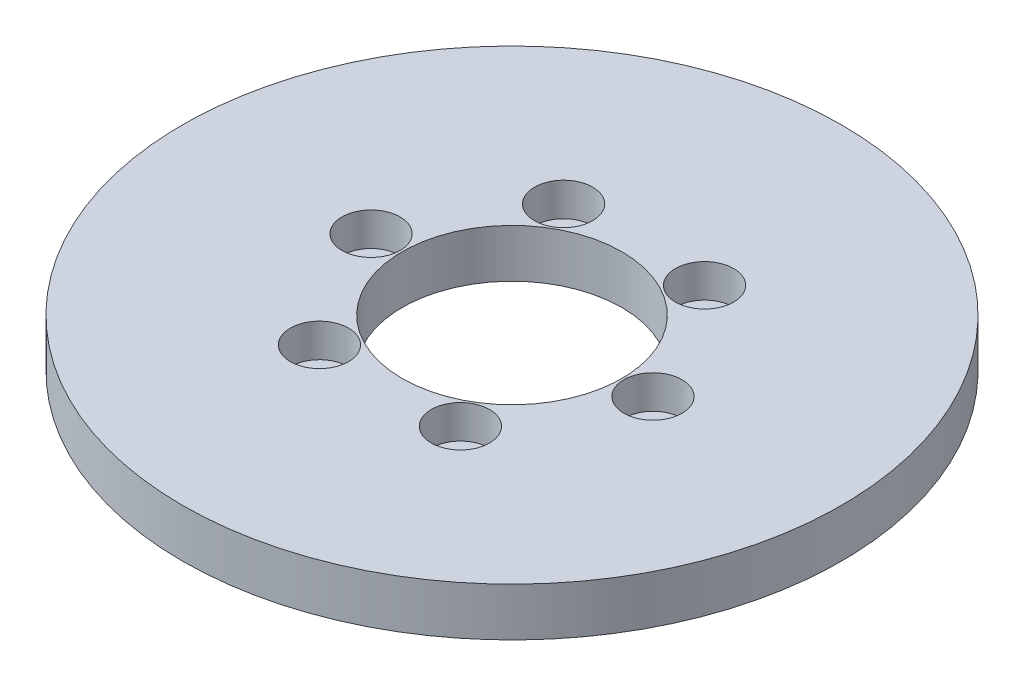
ISO-10303-21;
HEADER;
FILE_DESCRIPTION(('STEP AP214'),'2;1');
FILE_NAME('part.step','',(''),(''),'','','');
FILE_SCHEMA(('AUTOMOTIVE_DESIGN { 1 0 10303 214 1 1 1 1 }'));
ENDSEC;
DATA;
#1=APPLICATION_CONTEXT('core data for automotive mechanical design processes');
#2=APPLICATION_PROTOCOL_DEFINITION('international standard','automotive_design',2000,#1);
#3=PRODUCT_CONTEXT('',#1,'mechanical');
#4=PRODUCT('Part','Part','',(#3));
#5=PRODUCT_RELATED_PRODUCT_CATEGORY('part','',(#4));
#6=PRODUCT_DEFINITION_FORMATION('','',#4);
#7=PRODUCT_DEFINITION_CONTEXT('part definition',#1,'design');
#8=PRODUCT_DEFINITION('design','',#6,#7);
#9=PRODUCT_DEFINITION_SHAPE('','',#8);
#10=(LENGTH_UNIT() NAMED_UNIT(*) SI_UNIT(.MILLI.,.METRE.));
#11=(NAMED_UNIT(*) PLANE_ANGLE_UNIT() SI_UNIT($,.RADIAN.));
#12=(NAMED_UNIT(*) SI_UNIT($,.STERADIAN.) SOLID_ANGLE_UNIT());
#13=UNCERTAINTY_MEASURE_WITH_UNIT(LENGTH_MEASURE(1.E-05),#10,'distance_accuracy_value','');
#14=(GEOMETRIC_REPRESENTATION_CONTEXT(3) GLOBAL_UNCERTAINTY_ASSIGNED_CONTEXT((#13)) GLOBAL_UNIT_ASSIGNED_CONTEXT((#10,
#11,#12)) REPRESENTATION_CONTEXT('',''));
#15=CARTESIAN_POINT('',(0.,0.,0.));
#16=DIRECTION('',(0.,0.,1.));
#17=DIRECTION('',(1.,0.,0.));
#18=AXIS2_PLACEMENT_3D('',#15,#16,#17);
#19=CARTESIAN_POINT('',(0.,11.,0.));
#20=DIRECTION('',(0.,-1.,0.));
#21=DIRECTION('',(0.,0.,-1.));
#22=AXIS2_PLACEMENT_3D('',#19,#20,#21);
#23=CYLINDRICAL_SURFACE('',#22,75.);
#24=CARTESIAN_POINT('',(0.,11.,0.));
#25=DIRECTION('',(0.,1.,0.));
#26=DIRECTION('',(0.,0.,1.));
#27=AXIS2_PLACEMENT_3D('',#24,#25,#26);
#28=CIRCLE('',#27,75.);
#29=CARTESIAN_POINT('',(0.,11.,75.));
#30=VERTEX_POINT('',#29);
#31=EDGE_CURVE('E10',#30,#30,#28,.T.);
#32=ORIENTED_EDGE('',*,*,#31,.F.);
#33=EDGE_LOOP('',(#32));
#34=FACE_BOUND('',#33,.T.);
#35=CARTESIAN_POINT('',(0.,0.,0.));
#36=DIRECTION('',(0.,1.,0.));
#37=DIRECTION('',(0.,0.,1.));
#38=AXIS2_PLACEMENT_3D('',#35,#36,#37);
#39=CIRCLE('',#38,75.);
#40=CARTESIAN_POINT('',(0.,0.,75.));
#41=VERTEX_POINT('',#40);
#42=EDGE_CURVE('E37',#41,#41,#39,.T.);
#43=ORIENTED_EDGE('',*,*,#42,.T.);
#44=EDGE_LOOP('',(#43));
#45=FACE_BOUND('',#44,.T.);
#46=ADVANCED_FACE('F40',(#34,#45),#23,.T.);
#47=CARTESIAN_POINT('',(0.,11.,0.));
#48=DIRECTION('',(0.,1.,0.));
#49=DIRECTION('',(0.,0.,1.));
#50=AXIS2_PLACEMENT_3D('',#47,#48,#49);
#51=PLANE('',#50);
#52=CARTESIAN_POINT('',(-16.0389887368845,11.,-27.7803433943082));
#53=DIRECTION('',(0.,1.,0.));
#54=DIRECTION('',(-0.866025403784433,0.,0.50000000000001));
#55=AXIS2_PLACEMENT_3D('',#52,#53,#54);
#56=CIRCLE('',#55,6.62183561567318);
#57=CARTESIAN_POINT('',(-21.773666599742,11.,-24.4694255864716));
#58=VERTEX_POINT('',#57);
#59=EDGE_CURVE('E70',#58,#58,#56,.T.);
#60=ORIENTED_EDGE('',*,*,#59,.F.);
#61=EDGE_LOOP('',(#60));
#62=FACE_BOUND('',#61,.T.);
#63=CARTESIAN_POINT('',(16.038988736884,11.,-27.7803433943086));
#64=DIRECTION('',(0.,1.,0.));
#65=DIRECTION('',(-0.866025403784443,0.,-0.499999999999992));
#66=AXIS2_PLACEMENT_3D('',#63,#64,#65);
#67=CIRCLE('',#66,6.62183561567318);
#68=CARTESIAN_POINT('',(10.3043108740264,11.,-31.0912612021451));
#69=VERTEX_POINT('',#68);
#70=EDGE_CURVE('E71',#69,#69,#67,.T.);
#71=ORIENTED_EDGE('',*,*,#70,.F.);
#72=EDGE_LOOP('',(#71));
#73=FACE_BOUND('',#72,.T.);
#74=CARTESIAN_POINT('',(32.0779774737684,11.,0.));
#75=DIRECTION('',(0.,1.,0.));
#76=DIRECTION('',(0.,0.,-1.));
#77=AXIS2_PLACEMENT_3D('',#74,#75,#76);
#78=CIRCLE('',#77,6.62183561567318);
#79=CARTESIAN_POINT('',(32.0779774737684,11.,-6.62183561567318));
#80=VERTEX_POINT('',#79);
#81=EDGE_CURVE('E78',#80,#80,#78,.T.);
#82=ORIENTED_EDGE('',*,*,#81,.F.);
#83=EDGE_LOOP('',(#82));
#84=FACE_BOUND('',#83,.T.);
#85=CARTESIAN_POINT('',(16.0389887368843,11.,27.7803433943083));
#86=DIRECTION('',(0.,1.,0.));
#87=DIRECTION('',(0.866025403784436,0.,-0.500000000000004));
#88=AXIS2_PLACEMENT_3D('',#85,#86,#87);
#89=CIRCLE('',#88,6.62183561567318);
#90=CARTESIAN_POINT('',(21.7736665997419,11.,24.4694255864717));
#91=VERTEX_POINT('',#90);
#92=EDGE_CURVE('E84',#91,#91,#89,.T.);
#93=ORIENTED_EDGE('',*,*,#92,.F.);
#94=EDGE_LOOP('',(#93));
#95=FACE_BOUND('',#94,.T.);
#96=CARTESIAN_POINT('',(-16.0389887368841,11.,27.7803433943085));
#97=DIRECTION('',(0.,1.,0.));
#98=DIRECTION('',(0.86602540378444,0.,0.499999999999998));
#99=AXIS2_PLACEMENT_3D('',#96,#97,#98);
#100=CIRCLE('',#99,6.62183561567318);
#101=CARTESIAN_POINT('',(-10.3043108740266,11.,31.091261202145));
#102=VERTEX_POINT('',#101);
#103=EDGE_CURVE('E61',#102,#102,#100,.T.);
#104=ORIENTED_EDGE('',*,*,#103,.F.);
#105=EDGE_LOOP('',(#104));
#106=FACE_BOUND('',#105,.T.);
#107=CARTESIAN_POINT('',(-32.0779774737684,11.,0.));
#108=DIRECTION('',(0.,1.,0.));
#109=DIRECTION('',(0.,0.,1.));
#110=AXIS2_PLACEMENT_3D('',#107,#108,#109);
#111=CIRCLE('',#110,6.62183561567318);
#112=CARTESIAN_POINT('',(-32.0779774737684,11.,6.62183561567318));
#113=VERTEX_POINT('',#112);
#114=EDGE_CURVE('E54',#113,#113,#111,.T.);
#115=ORIENTED_EDGE('',*,*,#114,.F.);
#116=EDGE_LOOP('',(#115));
#117=FACE_BOUND('',#116,.T.);
#118=CARTESIAN_POINT('',(0.,11.,0.));
#119=DIRECTION('',(0.,1.,0.));
#120=DIRECTION('',(0.,0.,1.));
#121=AXIS2_PLACEMENT_3D('',#118,#119,#120);
#122=CIRCLE('',#121,25.);
#123=CARTESIAN_POINT('',(0.,11.,25.));
#124=VERTEX_POINT('',#123);
#125=EDGE_CURVE('E50',#124,#124,#122,.T.);
#126=ORIENTED_EDGE('',*,*,#125,.F.);
#127=EDGE_LOOP('',(#126));
#128=FACE_BOUND('',#127,.T.);
#129=ORIENTED_EDGE('',*,*,#31,.T.);
#130=EDGE_LOOP('',(#129));
#131=FACE_BOUND('',#130,.T.);
#132=ADVANCED_FACE('F99',(#62,#73,#84,#95,#106,#117,#128,#131),#51,.T.);
#133=CARTESIAN_POINT('',(0.,0.,0.));
#134=DIRECTION('',(0.,1.,0.));
#135=DIRECTION('',(0.,0.,1.));
#136=AXIS2_PLACEMENT_3D('',#133,#134,#135);
#137=PLANE('',#136);
#138=CARTESIAN_POINT('',(0.,0.,0.));
#139=DIRECTION('',(0.,1.,0.));
#140=DIRECTION('',(0.,0.,1.));
#141=AXIS2_PLACEMENT_3D('',#138,#139,#140);
#142=CIRCLE('',#141,25.);
#143=CARTESIAN_POINT('',(0.,0.,25.));
#144=VERTEX_POINT('',#143);
#145=EDGE_CURVE('E47',#144,#144,#142,.T.);
#146=ORIENTED_EDGE('',*,*,#145,.T.);
#147=EDGE_LOOP('',(#146));
#148=FACE_BOUND('',#147,.T.);
#149=ORIENTED_EDGE('',*,*,#42,.F.);
#150=EDGE_LOOP('',(#149));
#151=FACE_BOUND('',#150,.T.);
#152=ADVANCED_FACE('F103',(#148,#151),#137,.F.);
#153=CARTESIAN_POINT('',(0.,11.,0.));
#154=DIRECTION('',(0.,-1.,0.));
#155=DIRECTION('',(0.,0.,-1.));
#156=AXIS2_PLACEMENT_3D('',#153,#154,#155);
#157=CYLINDRICAL_SURFACE('',#156,25.);
#158=ORIENTED_EDGE('',*,*,#125,.T.);
#159=EDGE_LOOP('',(#158));
#160=FACE_BOUND('',#159,.T.);
#161=ORIENTED_EDGE('',*,*,#145,.F.);
#162=EDGE_LOOP('',(#161));
#163=FACE_BOUND('',#162,.T.);
#164=ADVANCED_FACE('F115',(#160,#163),#157,.F.);
#165=CARTESIAN_POINT('',(-32.0779774737684,3.39751569504377,0.));
#166=DIRECTION('',(0.,1.,0.));
#167=DIRECTION('',(0.,0.,1.));
#168=AXIS2_PLACEMENT_3D('',#165,#166,#167);
#169=CYLINDRICAL_SURFACE('',#168,6.62183561567318);
#170=CARTESIAN_POINT('',(-32.0779774737684,3.39751569504377,0.));
#171=DIRECTION('',(0.,1.,0.));
#172=DIRECTION('',(0.,0.,1.));
#173=AXIS2_PLACEMENT_3D('',#170,#171,#172);
#174=CIRCLE('',#173,6.62183561567318);
#175=CARTESIAN_POINT('',(-32.0779774737684,3.39751569504377,6.62183561567318));
#176=VERTEX_POINT('',#175);
#177=EDGE_CURVE('E55',#176,#176,#174,.T.);
#178=ORIENTED_EDGE('',*,*,#177,.F.);
#179=EDGE_LOOP('',(#178));
#180=FACE_BOUND('',#179,.T.);
#181=ORIENTED_EDGE('',*,*,#114,.T.);
#182=EDGE_LOOP('',(#181));
#183=FACE_BOUND('',#182,.T.);
#184=ADVANCED_FACE('F113',(#180,#183),#169,.F.);
#185=CARTESIAN_POINT('',(-32.0779774737684,3.39751569504377,0.));
#186=DIRECTION('',(0.,1.,0.));
#187=DIRECTION('',(0.,0.,1.));
#188=AXIS2_PLACEMENT_3D('',#185,#186,#187);
#189=PLANE('',#188);
#190=ORIENTED_EDGE('',*,*,#177,.T.);
#191=EDGE_LOOP('',(#190));
#192=FACE_BOUND('',#191,.T.);
#193=ADVANCED_FACE('F144',(#192),#189,.T.);
#194=CARTESIAN_POINT('',(-16.0389887368841,3.39751569504377,27.7803433943085));
#195=DIRECTION('',(0.,1.,0.));
#196=DIRECTION('',(0.,0.,1.));
#197=AXIS2_PLACEMENT_3D('',#194,#195,#196);
#198=CYLINDRICAL_SURFACE('',#197,6.62183561567318);
#199=CARTESIAN_POINT('',(-16.0389887368841,3.39751569504377,27.7803433943085));
#200=DIRECTION('',(0.,1.,0.));
#201=DIRECTION('',(0.86602540378444,0.,0.499999999999998));
#202=AXIS2_PLACEMENT_3D('',#199,#200,#201);
#203=CIRCLE('',#202,6.62183561567318);
#204=CARTESIAN_POINT('',(-10.3043108740266,3.39751569504377,31.091261202145));
#205=VERTEX_POINT('',#204);
#206=EDGE_CURVE('E59',#205,#205,#203,.T.);
#207=ORIENTED_EDGE('',*,*,#206,.F.);
#208=EDGE_LOOP('',(#207));
#209=FACE_BOUND('',#208,.T.);
#210=ORIENTED_EDGE('',*,*,#103,.T.);
#211=EDGE_LOOP('',(#210));
#212=FACE_BOUND('',#211,.T.);
#213=ADVANCED_FACE('F153',(#209,#212),#198,.F.);
#214=CARTESIAN_POINT('',(-16.0389887368841,3.39751569504377,27.7803433943085));
#215=DIRECTION('',(0.,1.,0.));
#216=DIRECTION('',(0.86602540378444,0.,0.499999999999998));
#217=AXIS2_PLACEMENT_3D('',#214,#215,#216);
#218=PLANE('',#217);
#219=ORIENTED_EDGE('',*,*,#206,.T.);
#220=EDGE_LOOP('',(#219));
#221=FACE_BOUND('',#220,.T.);
#222=ADVANCED_FACE('F96',(#221),#218,.T.);
#223=CARTESIAN_POINT('',(16.0389887368843,3.39751569504377,27.7803433943083));
#224=DIRECTION('',(0.,1.,0.));
#225=DIRECTION('',(0.,0.,1.));
#226=AXIS2_PLACEMENT_3D('',#223,#224,#225);
#227=CYLINDRICAL_SURFACE('',#226,6.62183561567318);
#228=CARTESIAN_POINT('',(16.0389887368843,3.39751569504377,27.7803433943083));
#229=DIRECTION('',(0.,1.,0.));
#230=DIRECTION('',(0.866025403784436,0.,-0.500000000000004));
#231=AXIS2_PLACEMENT_3D('',#228,#229,#230);
#232=CIRCLE('',#231,6.62183561567318);
#233=CARTESIAN_POINT('',(21.7736665997419,3.39751569504377,24.4694255864717));
#234=VERTEX_POINT('',#233);
#235=EDGE_CURVE('E63',#234,#234,#232,.T.);
#236=ORIENTED_EDGE('',*,*,#235,.F.);
#237=EDGE_LOOP('',(#236));
#238=FACE_BOUND('',#237,.T.);
#239=ORIENTED_EDGE('',*,*,#92,.T.);
#240=EDGE_LOOP('',(#239));
#241=FACE_BOUND('',#240,.T.);
#242=ADVANCED_FACE('F91',(#238,#241),#227,.F.);
#243=CARTESIAN_POINT('',(16.0389887368843,3.39751569504377,27.7803433943083));
#244=DIRECTION('',(0.,1.,0.));
#245=DIRECTION('',(0.866025403784436,0.,-0.500000000000004));
#246=AXIS2_PLACEMENT_3D('',#243,#244,#245);
#247=PLANE('',#246);
#248=ORIENTED_EDGE('',*,*,#235,.T.);
#249=EDGE_LOOP('',(#248));
#250=FACE_BOUND('',#249,.T.);
#251=ADVANCED_FACE('F93',(#250),#247,.T.);
#252=CARTESIAN_POINT('',(32.0779774737684,3.39751569504377,0.));
#253=DIRECTION('',(0.,1.,0.));
#254=DIRECTION('',(0.,0.,1.));
#255=AXIS2_PLACEMENT_3D('',#252,#253,#254);
#256=CYLINDRICAL_SURFACE('',#255,6.62183561567318);
#257=CARTESIAN_POINT('',(32.0779774737684,3.39751569504377,0.));
#258=DIRECTION('',(0.,1.,0.));
#259=DIRECTION('',(0.,0.,-1.));
#260=AXIS2_PLACEMENT_3D('',#257,#258,#259);
#261=CIRCLE('',#260,6.62183561567318);
#262=CARTESIAN_POINT('',(32.0779774737684,3.39751569504377,-6.62183561567318));
#263=VERTEX_POINT('',#262);
#264=EDGE_CURVE('E85',#263,#263,#261,.T.);
#265=ORIENTED_EDGE('',*,*,#264,.F.);
#266=EDGE_LOOP('',(#265));
#267=FACE_BOUND('',#266,.T.);
#268=ORIENTED_EDGE('',*,*,#81,.T.);
#269=EDGE_LOOP('',(#268));
#270=FACE_BOUND('',#269,.T.);
#271=ADVANCED_FACE('F187',(#267,#270),#256,.F.);
#272=CARTESIAN_POINT('',(32.0779774737684,3.39751569504377,0.));
#273=DIRECTION('',(0.,1.,0.));
#274=DIRECTION('',(0.,0.,-1.));
#275=AXIS2_PLACEMENT_3D('',#272,#273,#274);
#276=PLANE('',#275);
#277=ORIENTED_EDGE('',*,*,#264,.T.);
#278=EDGE_LOOP('',(#277));
#279=FACE_BOUND('',#278,.T.);
#280=ADVANCED_FACE('F198',(#279),#276,.T.);
#281=CARTESIAN_POINT('',(16.038988736884,3.39751569504377,-27.7803433943086));
#282=DIRECTION('',(0.,1.,0.));
#283=DIRECTION('',(0.,0.,1.));
#284=AXIS2_PLACEMENT_3D('',#281,#282,#283);
#285=CYLINDRICAL_SURFACE('',#284,6.62183561567318);
#286=CARTESIAN_POINT('',(16.038988736884,3.39751569504377,-27.7803433943086));
#287=DIRECTION('',(0.,1.,0.));
#288=DIRECTION('',(-0.866025403784443,0.,-0.499999999999992));
#289=AXIS2_PLACEMENT_3D('',#286,#287,#288);
#290=CIRCLE('',#289,6.62183561567318);
#291=CARTESIAN_POINT('',(10.3043108740264,3.39751569504377,-31.0912612021451));
#292=VERTEX_POINT('',#291);
#293=EDGE_CURVE('E76',#292,#292,#290,.T.);
#294=ORIENTED_EDGE('',*,*,#293,.F.);
#295=EDGE_LOOP('',(#294));
#296=FACE_BOUND('',#295,.T.);
#297=ORIENTED_EDGE('',*,*,#70,.T.);
#298=EDGE_LOOP('',(#297));
#299=FACE_BOUND('',#298,.T.);
#300=ADVANCED_FACE('F202',(#296,#299),#285,.F.);
#301=CARTESIAN_POINT('',(16.038988736884,3.39751569504377,-27.7803433943086));
#302=DIRECTION('',(0.,1.,0.));
#303=DIRECTION('',(-0.866025403784443,0.,-0.499999999999992));
#304=AXIS2_PLACEMENT_3D('',#301,#302,#303);
#305=PLANE('',#304);
#306=ORIENTED_EDGE('',*,*,#293,.T.);
#307=EDGE_LOOP('',(#306));
#308=FACE_BOUND('',#307,.T.);
#309=ADVANCED_FACE('F212',(#308),#305,.T.);
#310=CARTESIAN_POINT('',(-16.0389887368845,3.39751569504377,-27.7803433943082));
#311=DIRECTION('',(0.,1.,0.));
#312=DIRECTION('',(0.,0.,1.));
#313=AXIS2_PLACEMENT_3D('',#310,#311,#312);
#314=CYLINDRICAL_SURFACE('',#313,6.62183561567318);
#315=CARTESIAN_POINT('',(-16.0389887368845,3.39751569504377,-27.7803433943082));
#316=DIRECTION('',(0.,1.,0.));
#317=DIRECTION('',(-0.866025403784433,0.,0.50000000000001));
#318=AXIS2_PLACEMENT_3D('',#315,#316,#317);
#319=CIRCLE('',#318,6.62183561567318);
#320=CARTESIAN_POINT('',(-21.773666599742,3.39751569504377,-24.4694255864716));
#321=VERTEX_POINT('',#320);
#322=EDGE_CURVE('E69',#321,#321,#319,.T.);
#323=ORIENTED_EDGE('',*,*,#322,.F.);
#324=EDGE_LOOP('',(#323));
#325=FACE_BOUND('',#324,.T.);
#326=ORIENTED_EDGE('',*,*,#59,.T.);
#327=EDGE_LOOP('',(#326));
#328=FACE_BOUND('',#327,.T.);
#329=ADVANCED_FACE('F224',(#325,#328),#314,.F.);
#330=CARTESIAN_POINT('',(-16.0389887368845,3.39751569504377,-27.7803433943082));
#331=DIRECTION('',(0.,1.,0.));
#332=DIRECTION('',(-0.866025403784433,0.,0.50000000000001));
#333=AXIS2_PLACEMENT_3D('',#330,#331,#332);
#334=PLANE('',#333);
#335=ORIENTED_EDGE('',*,*,#322,.T.);
#336=EDGE_LOOP('',(#335));
#337=FACE_BOUND('',#336,.T.);
#338=ADVANCED_FACE('F235',(#337),#334,.T.);
#339=CLOSED_SHELL('',(#46,#132,#152,#164,#184,#193,#213,#222,#242,#251,#271,#280,#300,#309,#329,#338));
#340=MANIFOLD_SOLID_BREP('B2',#339);
#341=ADVANCED_BREP_SHAPE_REPRESENTATION('',(#18,#340),#14);
#342=SHAPE_DEFINITION_REPRESENTATION(#9,#341);
ENDSEC;
END-ISO-10303-21;
